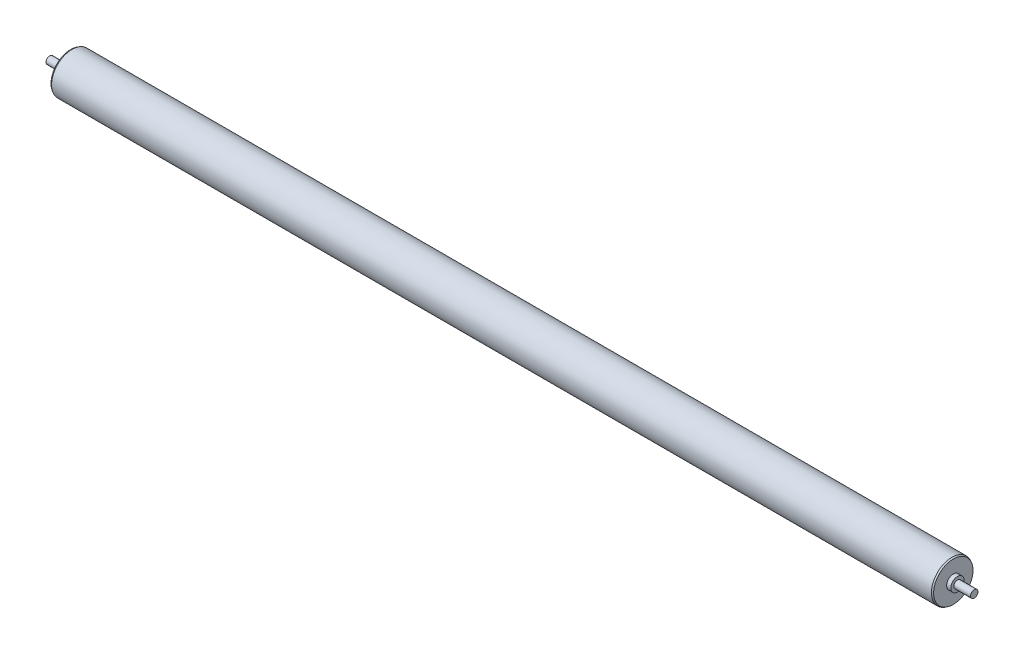
ISO-10303-21;
HEADER;
FILE_DESCRIPTION(('STEP AP214'),'2;1');
FILE_NAME('part.step','',(''),(''),'','','');
FILE_SCHEMA(('AUTOMOTIVE_DESIGN { 1 0 10303 214 1 1 1 1 }'));
ENDSEC;
DATA;
#1=APPLICATION_CONTEXT('core data for automotive mechanical design processes');
#2=APPLICATION_PROTOCOL_DEFINITION('international standard','automotive_design',2000,#1);
#3=PRODUCT_CONTEXT('',#1,'mechanical');
#4=PRODUCT('Part','Part','',(#3));
#5=PRODUCT_RELATED_PRODUCT_CATEGORY('part','',(#4));
#6=PRODUCT_DEFINITION_FORMATION('','',#4);
#7=PRODUCT_DEFINITION_CONTEXT('part definition',#1,'design');
#8=PRODUCT_DEFINITION('design','',#6,#7);
#9=PRODUCT_DEFINITION_SHAPE('','',#8);
#10=(LENGTH_UNIT() NAMED_UNIT(*) SI_UNIT(.MILLI.,.METRE.));
#11=(NAMED_UNIT(*) PLANE_ANGLE_UNIT() SI_UNIT($,.RADIAN.));
#12=(NAMED_UNIT(*) SI_UNIT($,.STERADIAN.) SOLID_ANGLE_UNIT());
#13=UNCERTAINTY_MEASURE_WITH_UNIT(LENGTH_MEASURE(1.E-05),#10,'distance_accuracy_value','');
#14=(GEOMETRIC_REPRESENTATION_CONTEXT(3) GLOBAL_UNCERTAINTY_ASSIGNED_CONTEXT((#13)) GLOBAL_UNIT_ASSIGNED_CONTEXT((#10,
#11,#12)) REPRESENTATION_CONTEXT('',''));
#15=CARTESIAN_POINT('',(0.,0.,0.));
#16=DIRECTION('',(0.,0.,1.));
#17=DIRECTION('',(1.,0.,0.));
#18=AXIS2_PLACEMENT_3D('',#15,#16,#17);
#19=CARTESIAN_POINT('',(393.7,0.,0.));
#20=DIRECTION('',(-1.,0.,0.));
#21=DIRECTION('',(0.,0.,1.));
#22=AXIS2_PLACEMENT_3D('',#19,#20,#21);
#23=PLANE('',#22);
#24=CARTESIAN_POINT('',(393.7,0.,0.));
#25=DIRECTION('',(-1.,0.,0.));
#26=DIRECTION('',(0.,0.,1.));
#27=AXIS2_PLACEMENT_3D('',#24,#25,#26);
#28=CIRCLE('',#27,3.17499999999994);
#29=CARTESIAN_POINT('',(393.7,0.,3.17499999999994));
#30=VERTEX_POINT('',#29);
#31=EDGE_CURVE('E10',#30,#30,#28,.T.);
#32=ORIENTED_EDGE('',*,*,#31,.F.);
#33=EDGE_LOOP('',(#32));
#34=FACE_BOUND('',#33,.T.);
#35=ADVANCED_FACE('F30',(#34),#23,.F.);
#36=CARTESIAN_POINT('',(-393.7,0.,0.));
#37=DIRECTION('',(-1.,0.,0.));
#38=DIRECTION('',(0.,0.,1.));
#39=AXIS2_PLACEMENT_3D('',#36,#37,#38);
#40=CYLINDRICAL_SURFACE('',#39,3.17499999999994);
#41=CARTESIAN_POINT('',(379.4125,0.,0.));
#42=DIRECTION('',(-1.,0.,0.));
#43=DIRECTION('',(0.,0.,1.));
#44=AXIS2_PLACEMENT_3D('',#41,#42,#43);
#45=CIRCLE('',#44,3.17499999999994);
#46=CARTESIAN_POINT('',(379.4125,0.,3.17499999999994));
#47=VERTEX_POINT('',#46);
#48=EDGE_CURVE('E36',#47,#47,#45,.T.);
#49=ORIENTED_EDGE('',*,*,#48,.F.);
#50=EDGE_LOOP('',(#49));
#51=FACE_BOUND('',#50,.T.);
#52=ORIENTED_EDGE('',*,*,#31,.T.);
#53=EDGE_LOOP('',(#52));
#54=FACE_BOUND('',#53,.T.);
#55=ADVANCED_FACE('F132',(#51,#54),#40,.T.);
#56=CARTESIAN_POINT('',(379.4125,-3.17499999999997,0.));
#57=DIRECTION('',(-1.,0.,0.));
#58=DIRECTION('',(0.,0.,1.));
#59=AXIS2_PLACEMENT_3D('',#56,#57,#58);
#60=PLANE('',#59);
#61=CARTESIAN_POINT('',(379.4125,0.,0.));
#62=DIRECTION('',(-1.,0.,0.));
#63=DIRECTION('',(0.,0.,1.));
#64=AXIS2_PLACEMENT_3D('',#61,#62,#63);
#65=CIRCLE('',#64,5.71499999999997);
#66=CARTESIAN_POINT('',(379.4125,0.,5.71499999999997));
#67=VERTEX_POINT('',#66);
#68=EDGE_CURVE('E40',#67,#67,#65,.T.);
#69=ORIENTED_EDGE('',*,*,#68,.F.);
#70=EDGE_LOOP('',(#69));
#71=FACE_BOUND('',#70,.T.);
#72=ORIENTED_EDGE('',*,*,#48,.T.);
#73=EDGE_LOOP('',(#72));
#74=FACE_BOUND('',#73,.T.);
#75=ADVANCED_FACE('F127',(#71,#74),#60,.F.);
#76=CARTESIAN_POINT('',(-393.7,0.,0.));
#77=DIRECTION('',(-1.,0.,0.));
#78=DIRECTION('',(0.,0.,1.));
#79=AXIS2_PLACEMENT_3D('',#76,#77,#78);
#80=CYLINDRICAL_SURFACE('',#79,5.71499999999997);
#81=CARTESIAN_POINT('',(375.840625,0.,0.));
#82=DIRECTION('',(-1.,0.,0.));
#83=DIRECTION('',(0.,0.,1.));
#84=AXIS2_PLACEMENT_3D('',#81,#82,#83);
#85=CIRCLE('',#84,5.71499999999997);
#86=CARTESIAN_POINT('',(375.840625,0.,5.71499999999997));
#87=VERTEX_POINT('',#86);
#88=EDGE_CURVE('E44',#87,#87,#85,.T.);
#89=ORIENTED_EDGE('',*,*,#88,.F.);
#90=EDGE_LOOP('',(#89));
#91=FACE_BOUND('',#90,.T.);
#92=ORIENTED_EDGE('',*,*,#68,.T.);
#93=EDGE_LOOP('',(#92));
#94=FACE_BOUND('',#93,.T.);
#95=ADVANCED_FACE('F121',(#91,#94),#80,.T.);
#96=CARTESIAN_POINT('',(375.840625,-5.715,0.));
#97=DIRECTION('',(-1.,0.,0.));
#98=DIRECTION('',(0.,0.,1.));
#99=AXIS2_PLACEMENT_3D('',#96,#97,#98);
#100=PLANE('',#99);
#101=CARTESIAN_POINT('',(375.840625,0.,0.));
#102=DIRECTION('',(-1.,0.,0.));
#103=DIRECTION('',(0.,0.,1.));
#104=AXIS2_PLACEMENT_3D('',#101,#102,#103);
#105=CIRCLE('',#104,16.7750923357461);
#106=CARTESIAN_POINT('',(375.840625,0.,16.7750923357461));
#107=VERTEX_POINT('',#106);
#108=EDGE_CURVE('E49',#107,#107,#105,.T.);
#109=ORIENTED_EDGE('',*,*,#108,.F.);
#110=EDGE_LOOP('',(#109));
#111=FACE_BOUND('',#110,.T.);
#112=ORIENTED_EDGE('',*,*,#88,.T.);
#113=EDGE_LOOP('',(#112));
#114=FACE_BOUND('',#113,.T.);
#115=ADVANCED_FACE('F115',(#111,#114),#100,.F.);
#116=CARTESIAN_POINT('',(375.840625,0.,0.));
#117=DIRECTION('',(-1.,0.,0.));
#118=DIRECTION('',(0.,0.,1.));
#119=AXIS2_PLACEMENT_3D('',#116,#117,#118);
#120=CONICAL_SURFACE('',#119,16.7750923357461,0.523598775598293);
#121=CARTESIAN_POINT('',(374.65,0.,0.));
#122=DIRECTION('',(-1.,0.,0.));
#123=DIRECTION('',(0.,0.,1.));
#124=AXIS2_PLACEMENT_3D('',#121,#122,#123);
#125=CIRCLE('',#124,17.4625);
#126=CARTESIAN_POINT('',(374.65,0.,17.4625));
#127=VERTEX_POINT('',#126);
#128=EDGE_CURVE('E52',#127,#127,#125,.T.);
#129=ORIENTED_EDGE('',*,*,#128,.F.);
#130=EDGE_LOOP('',(#129));
#131=FACE_BOUND('',#130,.T.);
#132=ORIENTED_EDGE('',*,*,#108,.T.);
#133=EDGE_LOOP('',(#132));
#134=FACE_BOUND('',#133,.T.);
#135=ADVANCED_FACE('F109',(#131,#134),#120,.T.);
#136=CARTESIAN_POINT('',(-393.7,0.,0.));
#137=DIRECTION('',(-1.,0.,0.));
#138=DIRECTION('',(0.,0.,1.));
#139=AXIS2_PLACEMENT_3D('',#136,#137,#138);
#140=CYLINDRICAL_SURFACE('',#139,17.4625);
#141=CARTESIAN_POINT('',(-374.65,0.,0.));
#142=DIRECTION('',(-1.,0.,0.));
#143=DIRECTION('',(0.,0.,1.));
#144=AXIS2_PLACEMENT_3D('',#141,#142,#143);
#145=CIRCLE('',#144,17.4625);
#146=CARTESIAN_POINT('',(-374.65,0.,17.4625));
#147=VERTEX_POINT('',#146);
#148=EDGE_CURVE('E55',#147,#147,#145,.T.);
#149=ORIENTED_EDGE('',*,*,#148,.F.);
#150=EDGE_LOOP('',(#149));
#151=FACE_BOUND('',#150,.T.);
#152=ORIENTED_EDGE('',*,*,#128,.T.);
#153=EDGE_LOOP('',(#152));
#154=FACE_BOUND('',#153,.T.);
#155=ADVANCED_FACE('F103',(#151,#154),#140,.T.);
#156=CARTESIAN_POINT('',(-374.65,0.,0.));
#157=DIRECTION('',(1.,0.,0.));
#158=DIRECTION('',(0.,0.,-1.));
#159=AXIS2_PLACEMENT_3D('',#156,#157,#158);
#160=CONICAL_SURFACE('',#159,17.4625,0.523598775598293);
#161=CARTESIAN_POINT('',(-375.840625,0.,0.));
#162=DIRECTION('',(-1.,0.,0.));
#163=DIRECTION('',(0.,0.,1.));
#164=AXIS2_PLACEMENT_3D('',#161,#162,#163);
#165=CIRCLE('',#164,16.7750923357461);
#166=CARTESIAN_POINT('',(-375.840625,0.,16.7750923357461));
#167=VERTEX_POINT('',#166);
#168=EDGE_CURVE('E58',#167,#167,#165,.T.);
#169=ORIENTED_EDGE('',*,*,#168,.F.);
#170=EDGE_LOOP('',(#169));
#171=FACE_BOUND('',#170,.T.);
#172=ORIENTED_EDGE('',*,*,#148,.T.);
#173=EDGE_LOOP('',(#172));
#174=FACE_BOUND('',#173,.T.);
#175=ADVANCED_FACE('F97',(#171,#174),#160,.T.);
#176=CARTESIAN_POINT('',(-375.840625,-5.715,0.));
#177=DIRECTION('',(1.,0.,0.));
#178=DIRECTION('',(0.,0.,-1.));
#179=AXIS2_PLACEMENT_3D('',#176,#177,#178);
#180=PLANE('',#179);
#181=CARTESIAN_POINT('',(-375.840625,0.,0.));
#182=DIRECTION('',(-1.,0.,0.));
#183=DIRECTION('',(0.,0.,1.));
#184=AXIS2_PLACEMENT_3D('',#181,#182,#183);
#185=CIRCLE('',#184,5.71499999999997);
#186=CARTESIAN_POINT('',(-375.840625,0.,5.71499999999997));
#187=VERTEX_POINT('',#186);
#188=EDGE_CURVE('E61',#187,#187,#185,.T.);
#189=ORIENTED_EDGE('',*,*,#188,.F.);
#190=EDGE_LOOP('',(#189));
#191=FACE_BOUND('',#190,.T.);
#192=ORIENTED_EDGE('',*,*,#168,.T.);
#193=EDGE_LOOP('',(#192));
#194=FACE_BOUND('',#193,.T.);
#195=ADVANCED_FACE('F91',(#191,#194),#180,.F.);
#196=CARTESIAN_POINT('',(-393.7,0.,0.));
#197=DIRECTION('',(-1.,0.,0.));
#198=DIRECTION('',(0.,0.,1.));
#199=AXIS2_PLACEMENT_3D('',#196,#197,#198);
#200=CYLINDRICAL_SURFACE('',#199,5.71499999999997);
#201=CARTESIAN_POINT('',(-379.4125,0.,0.));
#202=DIRECTION('',(-1.,0.,0.));
#203=DIRECTION('',(0.,0.,1.));
#204=AXIS2_PLACEMENT_3D('',#201,#202,#203);
#205=CIRCLE('',#204,5.71499999999997);
#206=CARTESIAN_POINT('',(-379.4125,0.,5.71499999999997));
#207=VERTEX_POINT('',#206);
#208=EDGE_CURVE('E64',#207,#207,#205,.T.);
#209=ORIENTED_EDGE('',*,*,#208,.F.);
#210=EDGE_LOOP('',(#209));
#211=FACE_BOUND('',#210,.T.);
#212=ORIENTED_EDGE('',*,*,#188,.T.);
#213=EDGE_LOOP('',(#212));
#214=FACE_BOUND('',#213,.T.);
#215=ADVANCED_FACE('F85',(#211,#214),#200,.T.);
#216=CARTESIAN_POINT('',(-379.4125,-3.17499999999997,0.));
#217=DIRECTION('',(1.,0.,0.));
#218=DIRECTION('',(0.,0.,-1.));
#219=AXIS2_PLACEMENT_3D('',#216,#217,#218);
#220=PLANE('',#219);
#221=CARTESIAN_POINT('',(-379.4125,0.,0.));
#222=DIRECTION('',(-1.,0.,0.));
#223=DIRECTION('',(0.,0.,1.));
#224=AXIS2_PLACEMENT_3D('',#221,#222,#223);
#225=CIRCLE('',#224,3.17499999999994);
#226=CARTESIAN_POINT('',(-379.4125,0.,3.17499999999994));
#227=VERTEX_POINT('',#226);
#228=EDGE_CURVE('E67',#227,#227,#225,.T.);
#229=ORIENTED_EDGE('',*,*,#228,.F.);
#230=EDGE_LOOP('',(#229));
#231=FACE_BOUND('',#230,.T.);
#232=ORIENTED_EDGE('',*,*,#208,.T.);
#233=EDGE_LOOP('',(#232));
#234=FACE_BOUND('',#233,.T.);
#235=ADVANCED_FACE('F79',(#231,#234),#220,.F.);
#236=CARTESIAN_POINT('',(-393.7,0.,0.));
#237=DIRECTION('',(-1.,0.,0.));
#238=DIRECTION('',(0.,0.,1.));
#239=AXIS2_PLACEMENT_3D('',#236,#237,#238);
#240=CYLINDRICAL_SURFACE('',#239,3.17499999999994);
#241=CARTESIAN_POINT('',(-393.7,0.,0.));
#242=DIRECTION('',(-1.,0.,0.));
#243=DIRECTION('',(0.,0.,1.));
#244=AXIS2_PLACEMENT_3D('',#241,#242,#243);
#245=CIRCLE('',#244,3.17499999999994);
#246=CARTESIAN_POINT('',(-393.7,0.,3.17499999999994));
#247=VERTEX_POINT('',#246);
#248=EDGE_CURVE('E70',#247,#247,#245,.T.);
#249=ORIENTED_EDGE('',*,*,#248,.F.);
#250=EDGE_LOOP('',(#249));
#251=FACE_BOUND('',#250,.T.);
#252=ORIENTED_EDGE('',*,*,#228,.T.);
#253=EDGE_LOOP('',(#252));
#254=FACE_BOUND('',#253,.T.);
#255=ADVANCED_FACE('F76',(#251,#254),#240,.T.);
#256=CARTESIAN_POINT('',(-393.7,0.,0.));
#257=DIRECTION('',(1.,0.,0.));
#258=DIRECTION('',(0.,0.,-1.));
#259=AXIS2_PLACEMENT_3D('',#256,#257,#258);
#260=PLANE('',#259);
#261=ORIENTED_EDGE('',*,*,#248,.T.);
#262=EDGE_LOOP('',(#261));
#263=FACE_BOUND('',#262,.T.);
#264=ADVANCED_FACE('F74',(#263),#260,.F.);
#265=CLOSED_SHELL('',(#35,#55,#75,#95,#115,#135,#155,#175,#195,#215,#235,#255,#264));
#266=MANIFOLD_SOLID_BREP('B2',#265);
#267=ADVANCED_BREP_SHAPE_REPRESENTATION('',(#18,#266),#14);
#268=SHAPE_DEFINITION_REPRESENTATION(#9,#267);
ENDSEC;
END-ISO-10303-21;
